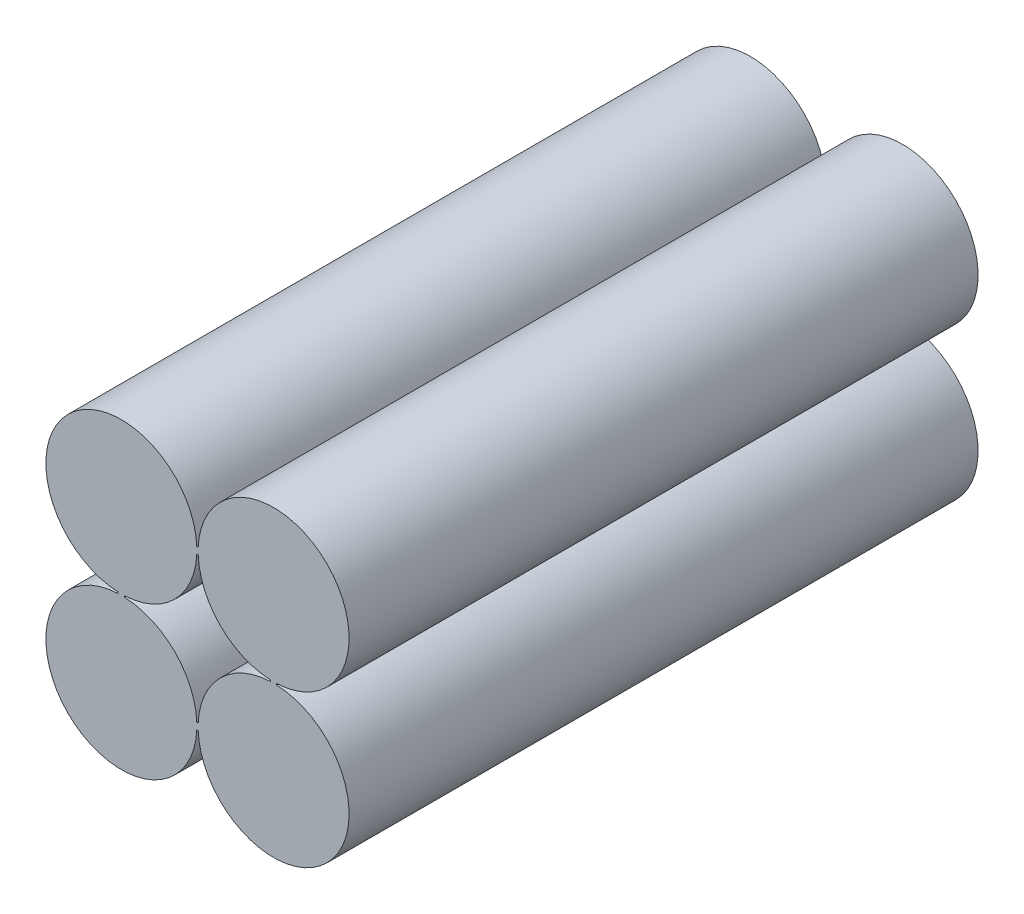
ISO-10303-21;
HEADER;
FILE_DESCRIPTION(('STEP AP214'),'2;1');
FILE_NAME('part.step','',(''),(''),'','','');
FILE_SCHEMA(('AUTOMOTIVE_DESIGN { 1 0 10303 214 1 1 1 1 }'));
ENDSEC;
DATA;
#1=APPLICATION_CONTEXT('core data for automotive mechanical design processes');
#2=APPLICATION_PROTOCOL_DEFINITION('international standard','automotive_design',2000,#1);
#3=PRODUCT_CONTEXT('',#1,'mechanical');
#4=PRODUCT('Part','Part','',(#3));
#5=PRODUCT_RELATED_PRODUCT_CATEGORY('part','',(#4));
#6=PRODUCT_DEFINITION_FORMATION('','',#4);
#7=PRODUCT_DEFINITION_CONTEXT('part definition',#1,'design');
#8=PRODUCT_DEFINITION('design','',#6,#7);
#9=PRODUCT_DEFINITION_SHAPE('','',#8);
#10=(LENGTH_UNIT() NAMED_UNIT(*) SI_UNIT(.MILLI.,.METRE.));
#11=(NAMED_UNIT(*) PLANE_ANGLE_UNIT() SI_UNIT($,.RADIAN.));
#12=(NAMED_UNIT(*) SI_UNIT($,.STERADIAN.) SOLID_ANGLE_UNIT());
#13=UNCERTAINTY_MEASURE_WITH_UNIT(LENGTH_MEASURE(1.E-05),#10,'distance_accuracy_value','');
#14=(GEOMETRIC_REPRESENTATION_CONTEXT(3) GLOBAL_UNCERTAINTY_ASSIGNED_CONTEXT((#13)) GLOBAL_UNIT_ASSIGNED_CONTEXT((#10,
#11,#12)) REPRESENTATION_CONTEXT('',''));
#15=CARTESIAN_POINT('',(0.,0.,0.));
#16=DIRECTION('',(0.,0.,1.));
#17=DIRECTION('',(1.,0.,0.));
#18=AXIS2_PLACEMENT_3D('',#15,#16,#17);
#19=CARTESIAN_POINT('',(12.1,-12.1,50.));
#20=DIRECTION('',(0.,0.,1.));
#21=DIRECTION('',(1.,0.,0.));
#22=AXIS2_PLACEMENT_3D('',#19,#20,#21);
#23=PLANE('',#22);
#24=CARTESIAN_POINT('',(12.1,-12.1,50.));
#25=DIRECTION('',(0.,0.,1.));
#26=DIRECTION('',(1.,0.,0.));
#27=AXIS2_PLACEMENT_3D('',#24,#25,#26);
#28=CIRCLE('',#27,6.);
#29=CARTESIAN_POINT('',(6.1052105958591,-12.35,50.));
#30=VERTEX_POINT('',#29);
#31=CARTESIAN_POINT('',(12.35,-6.1052105958591,50.));
#32=VERTEX_POINT('',#31);
#33=EDGE_CURVE('E212',#30,#32,#28,.T.);
#34=ORIENTED_EDGE('',*,*,#33,.T.);
#35=DIRECTION('',(0.,1.,0.));
#36=VECTOR('',#35,1.);
#37=CARTESIAN_POINT('',(12.35,-5.9947894041409,50.));
#38=LINE('',#37,#36);
#39=CARTESIAN_POINT('',(12.35,-5.9947894041409,50.));
#40=VERTEX_POINT('',#39);
#41=EDGE_CURVE('E215',#32,#40,#38,.T.);
#42=ORIENTED_EDGE('',*,*,#41,.T.);
#43=CARTESIAN_POINT('',(12.1,0.,50.));
#44=DIRECTION('',(0.,0.,1.));
#45=DIRECTION('',(1.,0.,0.));
#46=AXIS2_PLACEMENT_3D('',#43,#44,#45);
#47=CIRCLE('',#46,6.);
#48=CARTESIAN_POINT('',(6.1052105958591,0.250000000000006,50.));
#49=VERTEX_POINT('',#48);
#50=EDGE_CURVE('E218',#40,#49,#47,.T.);
#51=ORIENTED_EDGE('',*,*,#50,.T.);
#52=DIRECTION('',(-1.,0.,0.));
#53=VECTOR('',#52,1.);
#54=CARTESIAN_POINT('',(5.9947894041409,0.25,50.));
#55=LINE('',#54,#53);
#56=CARTESIAN_POINT('',(5.9947894041409,0.25,50.));
#57=VERTEX_POINT('',#56);
#58=EDGE_CURVE('E220',#49,#57,#55,.T.);
#59=ORIENTED_EDGE('',*,*,#58,.T.);
#60=CARTESIAN_POINT('',(0.,0.,50.));
#61=DIRECTION('',(0.,0.,1.));
#62=DIRECTION('',(1.,0.,0.));
#63=AXIS2_PLACEMENT_3D('',#60,#61,#62);
#64=CIRCLE('',#63,6.);
#65=CARTESIAN_POINT('',(-0.250000000000001,-5.9947894041409,50.));
#66=VERTEX_POINT('',#65);
#67=EDGE_CURVE('E222',#57,#66,#64,.T.);
#68=ORIENTED_EDGE('',*,*,#67,.T.);
#69=DIRECTION('',(0.,-1.,0.));
#70=VECTOR('',#69,1.);
#71=CARTESIAN_POINT('',(-0.249999999999999,-5.9947894041409,50.));
#72=LINE('',#71,#70);
#73=CARTESIAN_POINT('',(-0.249999999999999,-6.1052105958591,50.));
#74=VERTEX_POINT('',#73);
#75=EDGE_CURVE('E224',#66,#74,#72,.T.);
#76=ORIENTED_EDGE('',*,*,#75,.T.);
#77=CARTESIAN_POINT('',(0.,-12.1,50.));
#78=DIRECTION('',(0.,0.,1.));
#79=DIRECTION('',(1.,0.,0.));
#80=AXIS2_PLACEMENT_3D('',#77,#78,#79);
#81=CIRCLE('',#80,6.);
#82=CARTESIAN_POINT('',(5.9947894041409,-12.35,50.));
#83=VERTEX_POINT('',#82);
#84=EDGE_CURVE('E226',#74,#83,#81,.T.);
#85=ORIENTED_EDGE('',*,*,#84,.T.);
#86=DIRECTION('',(1.,0.,0.));
#87=VECTOR('',#86,1.);
#88=CARTESIAN_POINT('',(5.9947894041409,-12.35,50.));
#89=LINE('',#88,#87);
#90=EDGE_CURVE('E228',#83,#30,#89,.T.);
#91=ORIENTED_EDGE('',*,*,#90,.T.);
#92=EDGE_LOOP('',(#34,#42,#51,#59,#68,#76,#85,#91));
#93=FACE_BOUND('',#92,.T.);
#94=DIRECTION('',(-1.,0.,0.));
#95=VECTOR('',#94,1.);
#96=CARTESIAN_POINT('',(5.9947894041409,-0.25,50.));
#97=LINE('',#96,#95);
#98=CARTESIAN_POINT('',(6.1052105958591,-0.25,50.));
#99=VERTEX_POINT('',#98);
#100=CARTESIAN_POINT('',(5.9947894041409,-0.250000000000001,50.));
#101=VERTEX_POINT('',#100);
#102=EDGE_CURVE('E155',#99,#101,#97,.T.);
#103=ORIENTED_EDGE('',*,*,#102,.F.);
#104=CARTESIAN_POINT('',(12.1,0.,50.));
#105=DIRECTION('',(0.,0.,-1.));
#106=DIRECTION('',(1.,0.,0.));
#107=AXIS2_PLACEMENT_3D('',#104,#105,#106);
#108=CIRCLE('',#107,6.);
#109=CARTESIAN_POINT('',(11.85,-5.9947894041409,50.));
#110=VERTEX_POINT('',#109);
#111=EDGE_CURVE('E147',#110,#99,#108,.T.);
#112=ORIENTED_EDGE('',*,*,#111,.F.);
#113=DIRECTION('',(0.,1.,0.));
#114=VECTOR('',#113,1.);
#115=CARTESIAN_POINT('',(11.85,-5.9947894041409,50.));
#116=LINE('',#115,#114);
#117=CARTESIAN_POINT('',(11.85,-6.1052105958591,50.));
#118=VERTEX_POINT('',#117);
#119=EDGE_CURVE('E180',#118,#110,#116,.T.);
#120=ORIENTED_EDGE('',*,*,#119,.F.);
#121=CARTESIAN_POINT('',(12.1,-12.1,50.));
#122=DIRECTION('',(0.,0.,-1.));
#123=DIRECTION('',(1.,0.,0.));
#124=AXIS2_PLACEMENT_3D('',#121,#122,#123);
#125=CIRCLE('',#124,6.);
#126=CARTESIAN_POINT('',(6.1052105958591,-11.85,50.));
#127=VERTEX_POINT('',#126);
#128=EDGE_CURVE('E178',#127,#118,#125,.T.);
#129=ORIENTED_EDGE('',*,*,#128,.F.);
#130=DIRECTION('',(1.,0.,0.));
#131=VECTOR('',#130,1.);
#132=CARTESIAN_POINT('',(5.9947894041409,-11.85,50.));
#133=LINE('',#132,#131);
#134=CARTESIAN_POINT('',(5.9947894041409,-11.85,50.));
#135=VERTEX_POINT('',#134);
#136=EDGE_CURVE('E176',#135,#127,#133,.T.);
#137=ORIENTED_EDGE('',*,*,#136,.F.);
#138=CARTESIAN_POINT('',(0.,-12.1,50.));
#139=DIRECTION('',(0.,0.,-1.));
#140=DIRECTION('',(1.,0.,0.));
#141=AXIS2_PLACEMENT_3D('',#138,#139,#140);
#142=CIRCLE('',#141,6.);
#143=CARTESIAN_POINT('',(0.25,-6.1052105958591,50.));
#144=VERTEX_POINT('',#143);
#145=EDGE_CURVE('E174',#144,#135,#142,.T.);
#146=ORIENTED_EDGE('',*,*,#145,.F.);
#147=DIRECTION('',(0.,-1.,0.));
#148=VECTOR('',#147,1.);
#149=CARTESIAN_POINT('',(0.250000000000001,-5.9947894041409,50.));
#150=LINE('',#149,#148);
#151=CARTESIAN_POINT('',(0.250000000000001,-5.9947894041409,50.));
#152=VERTEX_POINT('',#151);
#153=EDGE_CURVE('E170',#152,#144,#150,.T.);
#154=ORIENTED_EDGE('',*,*,#153,.F.);
#155=CARTESIAN_POINT('',(0.,0.,50.));
#156=DIRECTION('',(0.,0.,-1.));
#157=DIRECTION('',(1.,0.,0.));
#158=AXIS2_PLACEMENT_3D('',#155,#156,#157);
#159=CIRCLE('',#158,6.);
#160=EDGE_CURVE('E168',#101,#152,#159,.T.);
#161=ORIENTED_EDGE('',*,*,#160,.F.);
#162=EDGE_LOOP('',(#103,#112,#120,#129,#137,#146,#154,#161));
#163=FACE_BOUND('',#162,.T.);
#164=ADVANCED_FACE('F34',(#93,#163),#23,.T.);
#165=CARTESIAN_POINT('',(12.1,-12.1,0.));
#166=DIRECTION('',(0.,0.,1.));
#167=DIRECTION('',(1.,0.,0.));
#168=AXIS2_PLACEMENT_3D('',#165,#166,#167);
#169=PLANE('',#168);
#170=CARTESIAN_POINT('',(12.1,-12.1,0.));
#171=DIRECTION('',(0.,0.,1.));
#172=DIRECTION('',(1.,0.,0.));
#173=AXIS2_PLACEMENT_3D('',#170,#171,#172);
#174=CIRCLE('',#173,6.);
#175=CARTESIAN_POINT('',(6.1052105958591,-12.35,0.));
#176=VERTEX_POINT('',#175);
#177=CARTESIAN_POINT('',(12.35,-6.1052105958591,0.));
#178=VERTEX_POINT('',#177);
#179=EDGE_CURVE('E163',#176,#178,#174,.T.);
#180=ORIENTED_EDGE('',*,*,#179,.F.);
#181=DIRECTION('',(1.,0.,0.));
#182=VECTOR('',#181,1.);
#183=CARTESIAN_POINT('',(5.9947894041409,-12.35,0.));
#184=LINE('',#183,#182);
#185=CARTESIAN_POINT('',(5.9947894041409,-12.35,0.));
#186=VERTEX_POINT('',#185);
#187=EDGE_CURVE('E216',#186,#176,#184,.T.);
#188=ORIENTED_EDGE('',*,*,#187,.F.);
#189=CARTESIAN_POINT('',(0.,-12.1,0.));
#190=DIRECTION('',(0.,0.,1.));
#191=DIRECTION('',(1.,0.,0.));
#192=AXIS2_PLACEMENT_3D('',#189,#190,#191);
#193=CIRCLE('',#192,6.);
#194=CARTESIAN_POINT('',(-0.249999999999999,-6.1052105958591,0.));
#195=VERTEX_POINT('',#194);
#196=EDGE_CURVE('E243',#195,#186,#193,.T.);
#197=ORIENTED_EDGE('',*,*,#196,.F.);
#198=DIRECTION('',(0.,-1.,0.));
#199=VECTOR('',#198,1.);
#200=CARTESIAN_POINT('',(-0.249999999999999,-5.9947894041409,0.));
#201=LINE('',#200,#199);
#202=CARTESIAN_POINT('',(-0.250000000000001,-5.9947894041409,0.));
#203=VERTEX_POINT('',#202);
#204=EDGE_CURVE('E241',#203,#195,#201,.T.);
#205=ORIENTED_EDGE('',*,*,#204,.F.);
#206=CARTESIAN_POINT('',(0.,0.,0.));
#207=DIRECTION('',(0.,0.,1.));
#208=DIRECTION('',(1.,0.,0.));
#209=AXIS2_PLACEMENT_3D('',#206,#207,#208);
#210=CIRCLE('',#209,6.);
#211=CARTESIAN_POINT('',(5.9947894041409,0.25,0.));
#212=VERTEX_POINT('',#211);
#213=EDGE_CURVE('E239',#212,#203,#210,.T.);
#214=ORIENTED_EDGE('',*,*,#213,.F.);
#215=DIRECTION('',(-1.,0.,0.));
#216=VECTOR('',#215,1.);
#217=CARTESIAN_POINT('',(5.9947894041409,0.25,0.));
#218=LINE('',#217,#216);
#219=CARTESIAN_POINT('',(6.1052105958591,0.250000000000006,0.));
#220=VERTEX_POINT('',#219);
#221=EDGE_CURVE('E237',#220,#212,#218,.T.);
#222=ORIENTED_EDGE('',*,*,#221,.F.);
#223=CARTESIAN_POINT('',(12.1,0.,0.));
#224=DIRECTION('',(0.,0.,1.));
#225=DIRECTION('',(1.,0.,0.));
#226=AXIS2_PLACEMENT_3D('',#223,#224,#225);
#227=CIRCLE('',#226,6.);
#228=CARTESIAN_POINT('',(12.35,-5.9947894041409,0.));
#229=VERTEX_POINT('',#228);
#230=EDGE_CURVE('E235',#229,#220,#227,.T.);
#231=ORIENTED_EDGE('',*,*,#230,.F.);
#232=DIRECTION('',(0.,1.,0.));
#233=VECTOR('',#232,1.);
#234=CARTESIAN_POINT('',(12.35,-5.9947894041409,0.));
#235=LINE('',#234,#233);
#236=EDGE_CURVE('E233',#178,#229,#235,.T.);
#237=ORIENTED_EDGE('',*,*,#236,.F.);
#238=EDGE_LOOP('',(#180,#188,#197,#205,#214,#222,#231,#237));
#239=FACE_BOUND('',#238,.T.);
#240=CARTESIAN_POINT('',(12.1,0.,0.));
#241=DIRECTION('',(0.,0.,-1.));
#242=DIRECTION('',(1.,0.,0.));
#243=AXIS2_PLACEMENT_3D('',#240,#241,#242);
#244=CIRCLE('',#243,6.);
#245=CARTESIAN_POINT('',(11.85,-5.9947894041409,0.));
#246=VERTEX_POINT('',#245);
#247=CARTESIAN_POINT('',(6.1052105958591,-0.25,0.));
#248=VERTEX_POINT('',#247);
#249=EDGE_CURVE('E57',#246,#248,#244,.T.);
#250=ORIENTED_EDGE('',*,*,#249,.T.);
#251=DIRECTION('',(-1.,0.,0.));
#252=VECTOR('',#251,1.);
#253=CARTESIAN_POINT('',(5.9947894041409,-0.25,0.));
#254=LINE('',#253,#252);
#255=CARTESIAN_POINT('',(5.9947894041409,-0.250000000000001,0.));
#256=VERTEX_POINT('',#255);
#257=EDGE_CURVE('E162',#248,#256,#254,.T.);
#258=ORIENTED_EDGE('',*,*,#257,.T.);
#259=CARTESIAN_POINT('',(0.,0.,0.));
#260=DIRECTION('',(0.,0.,-1.));
#261=DIRECTION('',(1.,0.,0.));
#262=AXIS2_PLACEMENT_3D('',#259,#260,#261);
#263=CIRCLE('',#262,6.);
#264=CARTESIAN_POINT('',(0.250000000000001,-5.9947894041409,0.));
#265=VERTEX_POINT('',#264);
#266=EDGE_CURVE('E184',#256,#265,#263,.T.);
#267=ORIENTED_EDGE('',*,*,#266,.T.);
#268=DIRECTION('',(0.,-1.,0.));
#269=VECTOR('',#268,1.);
#270=CARTESIAN_POINT('',(0.250000000000001,-5.9947894041409,0.));
#271=LINE('',#270,#269);
#272=CARTESIAN_POINT('',(0.25,-6.1052105958591,0.));
#273=VERTEX_POINT('',#272);
#274=EDGE_CURVE('E187',#265,#273,#271,.T.);
#275=ORIENTED_EDGE('',*,*,#274,.T.);
#276=CARTESIAN_POINT('',(0.,-12.1,0.));
#277=DIRECTION('',(0.,0.,-1.));
#278=DIRECTION('',(1.,0.,0.));
#279=AXIS2_PLACEMENT_3D('',#276,#277,#278);
#280=CIRCLE('',#279,6.);
#281=CARTESIAN_POINT('',(5.9947894041409,-11.85,0.));
#282=VERTEX_POINT('',#281);
#283=EDGE_CURVE('E190',#273,#282,#280,.T.);
#284=ORIENTED_EDGE('',*,*,#283,.T.);
#285=DIRECTION('',(1.,0.,0.));
#286=VECTOR('',#285,1.);
#287=CARTESIAN_POINT('',(5.9947894041409,-11.85,0.));
#288=LINE('',#287,#286);
#289=CARTESIAN_POINT('',(6.1052105958591,-11.85,0.));
#290=VERTEX_POINT('',#289);
#291=EDGE_CURVE('E193',#282,#290,#288,.T.);
#292=ORIENTED_EDGE('',*,*,#291,.T.);
#293=CARTESIAN_POINT('',(12.1,-12.1,0.));
#294=DIRECTION('',(0.,0.,-1.));
#295=DIRECTION('',(1.,0.,0.));
#296=AXIS2_PLACEMENT_3D('',#293,#294,#295);
#297=CIRCLE('',#296,6.);
#298=CARTESIAN_POINT('',(11.85,-6.1052105958591,0.));
#299=VERTEX_POINT('',#298);
#300=EDGE_CURVE('E196',#290,#299,#297,.T.);
#301=ORIENTED_EDGE('',*,*,#300,.T.);
#302=DIRECTION('',(0.,1.,0.));
#303=VECTOR('',#302,1.);
#304=CARTESIAN_POINT('',(11.85,-5.9947894041409,0.));
#305=LINE('',#304,#303);
#306=EDGE_CURVE('E156',#299,#246,#305,.T.);
#307=ORIENTED_EDGE('',*,*,#306,.T.);
#308=EDGE_LOOP('',(#250,#258,#267,#275,#284,#292,#301,#307));
#309=FACE_BOUND('',#308,.T.);
#310=ADVANCED_FACE('F273',(#239,#309),#169,.F.);
#311=CARTESIAN_POINT('',(12.1,-12.1,50.));
#312=DIRECTION('',(0.,0.,-1.));
#313=DIRECTION('',(-1.,0.,0.));
#314=AXIS2_PLACEMENT_3D('',#311,#312,#313);
#315=CYLINDRICAL_SURFACE('',#314,6.);
#316=ORIENTED_EDGE('',*,*,#179,.T.);
#317=DIRECTION('',(0.,0.,-1.));
#318=VECTOR('',#317,1.);
#319=CARTESIAN_POINT('',(12.35,-6.1052105958591,50.));
#320=LINE('',#319,#318);
#321=EDGE_CURVE('E11',#32,#178,#320,.T.);
#322=ORIENTED_EDGE('',*,*,#321,.F.);
#323=ORIENTED_EDGE('',*,*,#33,.F.);
#324=DIRECTION('',(0.,0.,-1.));
#325=VECTOR('',#324,1.);
#326=CARTESIAN_POINT('',(6.1052105958591,-12.35,50.));
#327=LINE('',#326,#325);
#328=EDGE_CURVE('E230',#30,#176,#327,.T.);
#329=ORIENTED_EDGE('',*,*,#328,.T.);
#330=EDGE_LOOP('',(#316,#322,#323,#329));
#331=FACE_BOUND('',#330,.T.);
#332=ADVANCED_FACE('F36',(#331),#315,.T.);
#333=CARTESIAN_POINT('',(12.35,-5.9947894041409,50.));
#334=DIRECTION('',(-1.,0.,0.));
#335=DIRECTION('',(0.,0.,1.));
#336=AXIS2_PLACEMENT_3D('',#333,#334,#335);
#337=PLANE('',#336);
#338=ORIENTED_EDGE('',*,*,#236,.T.);
#339=DIRECTION('',(0.,0.,-1.));
#340=VECTOR('',#339,1.);
#341=CARTESIAN_POINT('',(12.35,-5.9947894041409,50.));
#342=LINE('',#341,#340);
#343=EDGE_CURVE('E42',#40,#229,#342,.T.);
#344=ORIENTED_EDGE('',*,*,#343,.F.);
#345=ORIENTED_EDGE('',*,*,#41,.F.);
#346=ORIENTED_EDGE('',*,*,#321,.T.);
#347=EDGE_LOOP('',(#338,#344,#345,#346));
#348=FACE_BOUND('',#347,.T.);
#349=ADVANCED_FACE('F290',(#348),#337,.F.);
#350=CARTESIAN_POINT('',(12.1,0.,50.));
#351=DIRECTION('',(0.,0.,-1.));
#352=DIRECTION('',(-1.,0.,0.));
#353=AXIS2_PLACEMENT_3D('',#350,#351,#352);
#354=CYLINDRICAL_SURFACE('',#353,6.);
#355=ORIENTED_EDGE('',*,*,#230,.T.);
#356=DIRECTION('',(0.,0.,-1.));
#357=VECTOR('',#356,1.);
#358=CARTESIAN_POINT('',(6.1052105958591,0.250000000000006,50.));
#359=LINE('',#358,#357);
#360=EDGE_CURVE('E260',#49,#220,#359,.T.);
#361=ORIENTED_EDGE('',*,*,#360,.F.);
#362=ORIENTED_EDGE('',*,*,#50,.F.);
#363=ORIENTED_EDGE('',*,*,#343,.T.);
#364=EDGE_LOOP('',(#355,#361,#362,#363));
#365=FACE_BOUND('',#364,.T.);
#366=ADVANCED_FACE('F267',(#365),#354,.T.);
#367=CARTESIAN_POINT('',(5.9947894041409,0.25,50.));
#368=DIRECTION('',(0.,-1.,0.));
#369=DIRECTION('',(0.,0.,-1.));
#370=AXIS2_PLACEMENT_3D('',#367,#368,#369);
#371=PLANE('',#370);
#372=ORIENTED_EDGE('',*,*,#221,.T.);
#373=DIRECTION('',(0.,0.,-1.));
#374=VECTOR('',#373,1.);
#375=CARTESIAN_POINT('',(5.9947894041409,0.25,50.));
#376=LINE('',#375,#374);
#377=EDGE_CURVE('E257',#57,#212,#376,.T.);
#378=ORIENTED_EDGE('',*,*,#377,.F.);
#379=ORIENTED_EDGE('',*,*,#58,.F.);
#380=ORIENTED_EDGE('',*,*,#360,.T.);
#381=EDGE_LOOP('',(#372,#378,#379,#380));
#382=FACE_BOUND('',#381,.T.);
#383=ADVANCED_FACE('F279',(#382),#371,.F.);
#384=CARTESIAN_POINT('',(0.,0.,50.));
#385=DIRECTION('',(0.,0.,-1.));
#386=DIRECTION('',(-1.,0.,0.));
#387=AXIS2_PLACEMENT_3D('',#384,#385,#386);
#388=CYLINDRICAL_SURFACE('',#387,6.);
#389=ORIENTED_EDGE('',*,*,#213,.T.);
#390=DIRECTION('',(0.,0.,-1.));
#391=VECTOR('',#390,1.);
#392=CARTESIAN_POINT('',(-0.250000000000001,-5.9947894041409,50.));
#393=LINE('',#392,#391);
#394=EDGE_CURVE('E254',#66,#203,#393,.T.);
#395=ORIENTED_EDGE('',*,*,#394,.F.);
#396=ORIENTED_EDGE('',*,*,#67,.F.);
#397=ORIENTED_EDGE('',*,*,#377,.T.);
#398=EDGE_LOOP('',(#389,#395,#396,#397));
#399=FACE_BOUND('',#398,.T.);
#400=ADVANCED_FACE('F283',(#399),#388,.T.);
#401=CARTESIAN_POINT('',(-0.249999999999999,-5.9947894041409,50.));
#402=DIRECTION('',(1.,0.,0.));
#403=DIRECTION('',(0.,1.,0.));
#404=AXIS2_PLACEMENT_3D('',#401,#402,#403);
#405=PLANE('',#404);
#406=ORIENTED_EDGE('',*,*,#204,.T.);
#407=DIRECTION('',(0.,0.,-1.));
#408=VECTOR('',#407,1.);
#409=CARTESIAN_POINT('',(-0.249999999999999,-6.1052105958591,50.));
#410=LINE('',#409,#408);
#411=EDGE_CURVE('E251',#74,#195,#410,.T.);
#412=ORIENTED_EDGE('',*,*,#411,.F.);
#413=ORIENTED_EDGE('',*,*,#75,.F.);
#414=ORIENTED_EDGE('',*,*,#394,.T.);
#415=EDGE_LOOP('',(#406,#412,#413,#414));
#416=FACE_BOUND('',#415,.T.);
#417=ADVANCED_FACE('F303',(#416),#405,.F.);
#418=CARTESIAN_POINT('',(0.,-12.1,50.));
#419=DIRECTION('',(0.,0.,-1.));
#420=DIRECTION('',(-1.,0.,0.));
#421=AXIS2_PLACEMENT_3D('',#418,#419,#420);
#422=CYLINDRICAL_SURFACE('',#421,6.);
#423=ORIENTED_EDGE('',*,*,#196,.T.);
#424=DIRECTION('',(0.,0.,-1.));
#425=VECTOR('',#424,1.);
#426=CARTESIAN_POINT('',(5.9947894041409,-12.35,50.));
#427=LINE('',#426,#425);
#428=EDGE_CURVE('E248',#83,#186,#427,.T.);
#429=ORIENTED_EDGE('',*,*,#428,.F.);
#430=ORIENTED_EDGE('',*,*,#84,.F.);
#431=ORIENTED_EDGE('',*,*,#411,.T.);
#432=EDGE_LOOP('',(#423,#429,#430,#431));
#433=FACE_BOUND('',#432,.T.);
#434=ADVANCED_FACE('F301',(#433),#422,.T.);
#435=CARTESIAN_POINT('',(5.9947894041409,-12.35,50.));
#436=DIRECTION('',(0.,1.,0.));
#437=DIRECTION('',(0.,0.,1.));
#438=AXIS2_PLACEMENT_3D('',#435,#436,#437);
#439=PLANE('',#438);
#440=ORIENTED_EDGE('',*,*,#187,.T.);
#441=ORIENTED_EDGE('',*,*,#328,.F.);
#442=ORIENTED_EDGE('',*,*,#90,.F.);
#443=ORIENTED_EDGE('',*,*,#428,.T.);
#444=EDGE_LOOP('',(#440,#441,#442,#443));
#445=FACE_BOUND('',#444,.T.);
#446=ADVANCED_FACE('F296',(#445),#439,.F.);
#447=CARTESIAN_POINT('',(12.1,0.,50.));
#448=DIRECTION('',(0.,0.,-1.));
#449=DIRECTION('',(-1.,0.,0.));
#450=AXIS2_PLACEMENT_3D('',#447,#448,#449);
#451=CYLINDRICAL_SURFACE('',#450,6.);
#452=ORIENTED_EDGE('',*,*,#249,.F.);
#453=DIRECTION('',(0.,0.,-1.));
#454=VECTOR('',#453,1.);
#455=CARTESIAN_POINT('',(11.85,-5.9947894041409,50.));
#456=LINE('',#455,#454);
#457=EDGE_CURVE('E151',#110,#246,#456,.T.);
#458=ORIENTED_EDGE('',*,*,#457,.F.);
#459=ORIENTED_EDGE('',*,*,#111,.T.);
#460=DIRECTION('',(0.,0.,-1.));
#461=VECTOR('',#460,1.);
#462=CARTESIAN_POINT('',(6.1052105958591,-0.25,50.));
#463=LINE('',#462,#461);
#464=EDGE_CURVE('E150',#99,#248,#463,.T.);
#465=ORIENTED_EDGE('',*,*,#464,.T.);
#466=EDGE_LOOP('',(#452,#458,#459,#465));
#467=FACE_BOUND('',#466,.T.);
#468=ADVANCED_FACE('F149',(#467),#451,.T.);
#469=CARTESIAN_POINT('',(5.9947894041409,-0.25,50.));
#470=DIRECTION('',(0.,-1.,0.));
#471=DIRECTION('',(0.,0.,-1.));
#472=AXIS2_PLACEMENT_3D('',#469,#470,#471);
#473=PLANE('',#472);
#474=ORIENTED_EDGE('',*,*,#257,.F.);
#475=ORIENTED_EDGE('',*,*,#464,.F.);
#476=ORIENTED_EDGE('',*,*,#102,.T.);
#477=DIRECTION('',(0.,0.,-1.));
#478=VECTOR('',#477,1.);
#479=CARTESIAN_POINT('',(5.9947894041409,-0.250000000000001,50.));
#480=LINE('',#479,#478);
#481=EDGE_CURVE('E164',#101,#256,#480,.T.);
#482=ORIENTED_EDGE('',*,*,#481,.T.);
#483=EDGE_LOOP('',(#474,#475,#476,#482));
#484=FACE_BOUND('',#483,.T.);
#485=ADVANCED_FACE('F159',(#484),#473,.T.);
#486=CARTESIAN_POINT('',(0.,0.,50.));
#487=DIRECTION('',(0.,0.,-1.));
#488=DIRECTION('',(-1.,0.,0.));
#489=AXIS2_PLACEMENT_3D('',#486,#487,#488);
#490=CYLINDRICAL_SURFACE('',#489,6.);
#491=ORIENTED_EDGE('',*,*,#266,.F.);
#492=ORIENTED_EDGE('',*,*,#481,.F.);
#493=ORIENTED_EDGE('',*,*,#160,.T.);
#494=DIRECTION('',(0.,0.,-1.));
#495=VECTOR('',#494,1.);
#496=CARTESIAN_POINT('',(0.250000000000001,-5.9947894041409,50.));
#497=LINE('',#496,#495);
#498=EDGE_CURVE('E209',#152,#265,#497,.T.);
#499=ORIENTED_EDGE('',*,*,#498,.T.);
#500=EDGE_LOOP('',(#491,#492,#493,#499));
#501=FACE_BOUND('',#500,.T.);
#502=ADVANCED_FACE('F328',(#501),#490,.T.);
#503=CARTESIAN_POINT('',(0.250000000000001,-5.9947894041409,50.));
#504=DIRECTION('',(1.,0.,0.));
#505=DIRECTION('',(0.,1.,0.));
#506=AXIS2_PLACEMENT_3D('',#503,#504,#505);
#507=PLANE('',#506);
#508=ORIENTED_EDGE('',*,*,#274,.F.);
#509=ORIENTED_EDGE('',*,*,#498,.F.);
#510=ORIENTED_EDGE('',*,*,#153,.T.);
#511=DIRECTION('',(0.,0.,-1.));
#512=VECTOR('',#511,1.);
#513=CARTESIAN_POINT('',(0.25,-6.1052105958591,50.));
#514=LINE('',#513,#512);
#515=EDGE_CURVE('E207',#144,#273,#514,.T.);
#516=ORIENTED_EDGE('',*,*,#515,.T.);
#517=EDGE_LOOP('',(#508,#509,#510,#516));
#518=FACE_BOUND('',#517,.T.);
#519=ADVANCED_FACE('F332',(#518),#507,.T.);
#520=CARTESIAN_POINT('',(0.,-12.1,50.));
#521=DIRECTION('',(0.,0.,-1.));
#522=DIRECTION('',(-1.,0.,0.));
#523=AXIS2_PLACEMENT_3D('',#520,#521,#522);
#524=CYLINDRICAL_SURFACE('',#523,6.);
#525=ORIENTED_EDGE('',*,*,#283,.F.);
#526=ORIENTED_EDGE('',*,*,#515,.F.);
#527=ORIENTED_EDGE('',*,*,#145,.T.);
#528=DIRECTION('',(0.,0.,-1.));
#529=VECTOR('',#528,1.);
#530=CARTESIAN_POINT('',(5.9947894041409,-11.85,50.));
#531=LINE('',#530,#529);
#532=EDGE_CURVE('E205',#135,#282,#531,.T.);
#533=ORIENTED_EDGE('',*,*,#532,.T.);
#534=EDGE_LOOP('',(#525,#526,#527,#533));
#535=FACE_BOUND('',#534,.T.);
#536=ADVANCED_FACE('F338',(#535),#524,.T.);
#537=CARTESIAN_POINT('',(5.9947894041409,-11.85,50.));
#538=DIRECTION('',(0.,1.,0.));
#539=DIRECTION('',(0.,0.,1.));
#540=AXIS2_PLACEMENT_3D('',#537,#538,#539);
#541=PLANE('',#540);
#542=ORIENTED_EDGE('',*,*,#291,.F.);
#543=ORIENTED_EDGE('',*,*,#532,.F.);
#544=ORIENTED_EDGE('',*,*,#136,.T.);
#545=DIRECTION('',(0.,0.,-1.));
#546=VECTOR('',#545,1.);
#547=CARTESIAN_POINT('',(6.1052105958591,-11.85,50.));
#548=LINE('',#547,#546);
#549=EDGE_CURVE('E203',#127,#290,#548,.T.);
#550=ORIENTED_EDGE('',*,*,#549,.T.);
#551=EDGE_LOOP('',(#542,#543,#544,#550));
#552=FACE_BOUND('',#551,.T.);
#553=ADVANCED_FACE('F342',(#552),#541,.T.);
#554=CARTESIAN_POINT('',(12.1,-12.1,50.));
#555=DIRECTION('',(0.,0.,-1.));
#556=DIRECTION('',(-1.,0.,0.));
#557=AXIS2_PLACEMENT_3D('',#554,#555,#556);
#558=CYLINDRICAL_SURFACE('',#557,6.);
#559=ORIENTED_EDGE('',*,*,#300,.F.);
#560=ORIENTED_EDGE('',*,*,#549,.F.);
#561=ORIENTED_EDGE('',*,*,#128,.T.);
#562=DIRECTION('',(0.,0.,-1.));
#563=VECTOR('',#562,1.);
#564=CARTESIAN_POINT('',(11.85,-6.1052105958591,50.));
#565=LINE('',#564,#563);
#566=EDGE_CURVE('E49',#118,#299,#565,.T.);
#567=ORIENTED_EDGE('',*,*,#566,.T.);
#568=EDGE_LOOP('',(#559,#560,#561,#567));
#569=FACE_BOUND('',#568,.T.);
#570=ADVANCED_FACE('F346',(#569),#558,.T.);
#571=CARTESIAN_POINT('',(11.85,-5.9947894041409,50.));
#572=DIRECTION('',(-1.,0.,0.));
#573=DIRECTION('',(0.,0.,1.));
#574=AXIS2_PLACEMENT_3D('',#571,#572,#573);
#575=PLANE('',#574);
#576=ORIENTED_EDGE('',*,*,#306,.F.);
#577=ORIENTED_EDGE('',*,*,#566,.F.);
#578=ORIENTED_EDGE('',*,*,#119,.T.);
#579=ORIENTED_EDGE('',*,*,#457,.T.);
#580=EDGE_LOOP('',(#576,#577,#578,#579));
#581=FACE_BOUND('',#580,.T.);
#582=ADVANCED_FACE('F350',(#581),#575,.T.);
#583=CLOSED_SHELL('',(#164,#310,#332,#349,#366,#383,#400,#417,#434,#446,#468,#485,#502,#519,
#536,#553,#570,#582));
#584=MANIFOLD_SOLID_BREP('B2',#583);
#585=ADVANCED_BREP_SHAPE_REPRESENTATION('',(#18,#584),#14);
#586=SHAPE_DEFINITION_REPRESENTATION(#9,#585);
ENDSEC;
END-ISO-10303-21;
